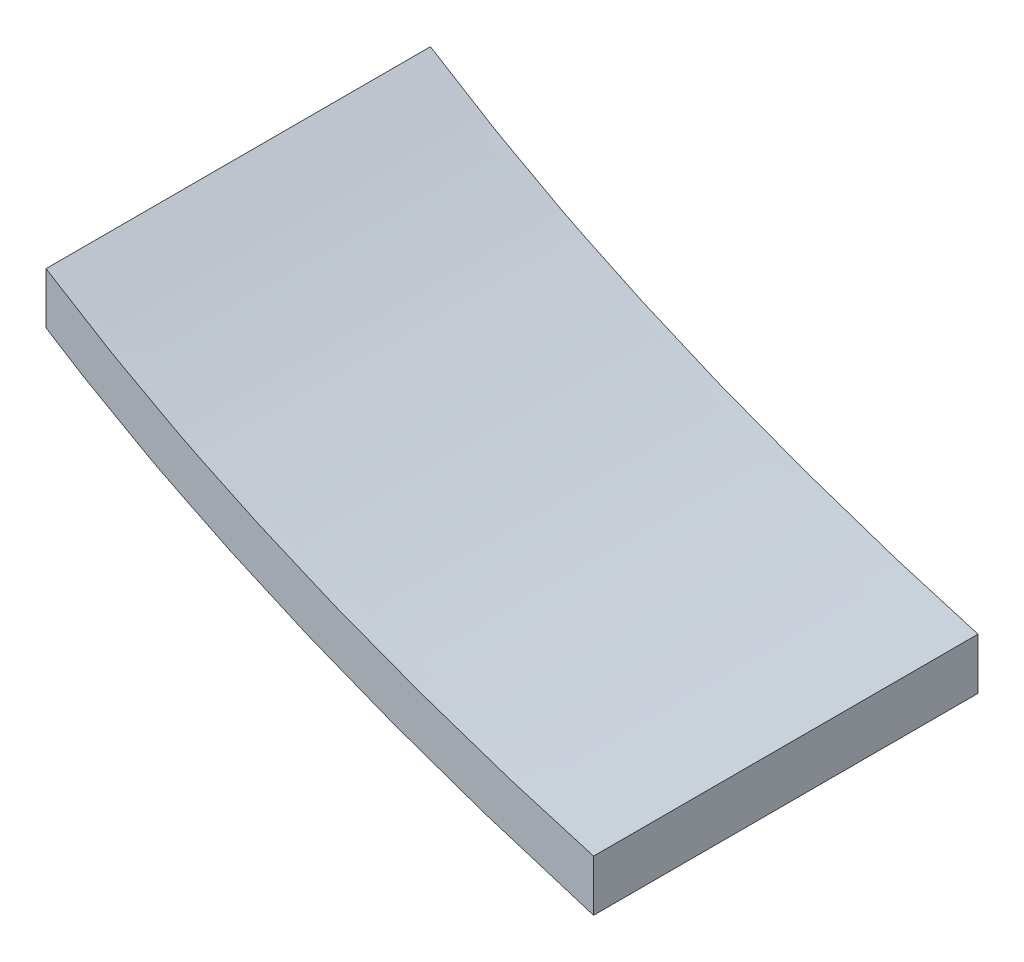
ISO-10303-21;
HEADER;
FILE_DESCRIPTION(('STEP AP214'),'2;1');
FILE_NAME('part.step','',(''),(''),'','','');
FILE_SCHEMA(('AUTOMOTIVE_DESIGN { 1 0 10303 214 1 1 1 1 }'));
ENDSEC;
DATA;
#1=APPLICATION_CONTEXT('core data for automotive mechanical design processes');
#2=APPLICATION_PROTOCOL_DEFINITION('international standard','automotive_design',2000,#1);
#3=PRODUCT_CONTEXT('',#1,'mechanical');
#4=PRODUCT('Part','Part','',(#3));
#5=PRODUCT_RELATED_PRODUCT_CATEGORY('part','',(#4));
#6=PRODUCT_DEFINITION_FORMATION('','',#4);
#7=PRODUCT_DEFINITION_CONTEXT('part definition',#1,'design');
#8=PRODUCT_DEFINITION('design','',#6,#7);
#9=PRODUCT_DEFINITION_SHAPE('','',#8);
#10=(LENGTH_UNIT() NAMED_UNIT(*) SI_UNIT(.MILLI.,.METRE.));
#11=(NAMED_UNIT(*) PLANE_ANGLE_UNIT() SI_UNIT($,.RADIAN.));
#12=(NAMED_UNIT(*) SI_UNIT($,.STERADIAN.) SOLID_ANGLE_UNIT());
#13=UNCERTAINTY_MEASURE_WITH_UNIT(LENGTH_MEASURE(1.E-05),#10,'distance_accuracy_value','');
#14=(GEOMETRIC_REPRESENTATION_CONTEXT(3) GLOBAL_UNCERTAINTY_ASSIGNED_CONTEXT((#13)) GLOBAL_UNIT_ASSIGNED_CONTEXT((#10,
#11,#12)) REPRESENTATION_CONTEXT('',''));
#15=CARTESIAN_POINT('',(0.,0.,0.));
#16=DIRECTION('',(0.,0.,1.));
#17=DIRECTION('',(1.,0.,0.));
#18=AXIS2_PLACEMENT_3D('',#15,#16,#17);
#19=CARTESIAN_POINT('',(0.,5.08,38.1));
#20=CARTESIAN_POINT('',(-2.66299660358424,5.86892612330493,38.1));
#21=CARTESIAN_POINT('',(-5.33725941297756,6.66118991668448,38.1));
#22=CARTESIAN_POINT('',(-8.02278842818282,7.45679138013968,38.1));
#23=CARTESIAN_POINT('',(-8.05651199886255,7.46706128449258,38.1));
#24=CARTESIAN_POINT('',(-8.11258412378838,7.48460329255471,38.1));
#25=CARTESIAN_POINT('',(-8.16865592145831,7.50214519823575,38.1));
#26=CARTESIAN_POINT('',(-8.22472739187246,7.51968700153572,38.1));
#27=CARTESIAN_POINT('',(-8.25825768898643,7.53057469398592,38.1));
#28=CARTESIAN_POINT('',(-11.206534394047,8.52314219338534,38.1));
#29=CARTESIAN_POINT('',(-14.1561430019538,9.51615809149655,38.1));
#30=CARTESIAN_POINT('',(-17.1070835127049,10.5096223883195,38.1));
#31=CARTESIAN_POINT('',(-17.1443836146619,10.5225241100001,38.1));
#32=CARTESIAN_POINT('',(-17.2063676074401,10.5445390973916,38.1));
#33=CARTESIAN_POINT('',(-17.2683513071834,10.5665539807053,38.1));
#34=CARTESIAN_POINT('',(-17.3303347138918,10.5885687599412,38.1));
#35=CARTESIAN_POINT('',(-17.3673835820756,10.6021778386223,38.1));
#36=CARTESIAN_POINT('',(-20.0720448471412,11.6288127143894,38.1));
#37=CARTESIAN_POINT('',(-22.7782649537858,12.6560392949849,38.1));
#38=CARTESIAN_POINT('',(-25.4860439020072,13.6838575804087,38.1));
#39=CARTESIAN_POINT('',(-25.5274412562662,13.7001075251253,38.1));
#40=CARTESIAN_POINT('',(-25.5961209807269,13.7279645036385,38.1));
#41=CARTESIAN_POINT('',(-25.6648010095304,13.7558216055952,38.1));
#42=CARTESIAN_POINT('',(-25.7334813426766,13.7836788309954,38.1));
#43=CARTESIAN_POINT('',(-25.7745381066301,13.8007684816882,38.1));
#44=CARTESIAN_POINT('',(-28.2590713259835,14.8615717552974,38.1));
#45=CARTESIAN_POINT('',(-30.7453277869751,15.923110788991,38.1));
#46=CARTESIAN_POINT('',(-33.233307489607,16.9853855827697,38.1));
#47=CARTESIAN_POINT('',(-33.279061910467,17.0058000697187,38.1));
#48=CARTESIAN_POINT('',(-33.3547465446443,17.0410438483114,38.1));
#49=CARTESIAN_POINT('',(-33.4304330538843,17.0762885000574,38.1));
#50=CARTESIAN_POINT('',(-33.5061214381868,17.1115340249568,38.1));
#51=CARTESIAN_POINT('',(-33.551459361371,17.1328429303718,38.1));
#52=CARTESIAN_POINT('',(-35.2974880174613,17.9610749104166,38.1));
#53=CARTESIAN_POINT('',(-37.1388137731881,18.8345112490779,38.1));
#54=CARTESIAN_POINT('',(-39.0754366285523,19.7531519463561,38.1));
#55=CARTESIAN_POINT('',(-39.4046383244067,19.9144152049986,38.1));
#56=CARTESIAN_POINT('',(-40.0883105494613,20.260055046833,38.1));
#57=CARTESIAN_POINT('',(-40.6796641544445,20.5590219479356,38.1));
#58=CARTESIAN_POINT('',(-41.178699139356,20.8113159083066,38.1));
#59=CARTESIAN_POINT('',(-41.2285243001655,20.8372938539547,38.1));
#60=CARTESIAN_POINT('',(-41.3110087118267,20.8816216632155,38.1));
#61=CARTESIAN_POINT('',(-41.3934943636765,20.925950138964,38.1));
#62=CARTESIAN_POINT('',(-41.4759812557149,20.9702792812001,38.1));
#63=CARTESIAN_POINT('',(-41.5254064441378,20.9970014906471,38.1));
#64=CARTESIAN_POINT('',(-43.1141773273524,21.8611657888336,38.1));
#65=CARTESIAN_POINT('',(-45.0464570828018,22.9121714413223,38.1));
#66=CARTESIAN_POINT('',(-47.3222457104867,24.1500184481135,38.1));
#67=CARTESIAN_POINT('',(-48.3862759509064,24.7672529837422,38.1));
#68=CARTESIAN_POINT('',(-50.6969881446039,26.1819543488048,38.1));
#69=CARTESIAN_POINT('',(-52.6582318041144,27.3826984699885,38.1));
#70=CARTESIAN_POINT('',(-54.2700069294378,28.3694853472933,38.1));
#71=B_SPLINE_CURVE_WITH_KNOTS('',3,(#19,#20,#21,#22,#23,#24,#25,#26,#27,#28,#29,#30,#31,#32,#33,
#34,#35,#36,#37,#38,#39,#40,#41,#42,#43,#44,#45,#46,#47,#48,#49,#50,#51,#52,#53,#54,#55,#56,#57,
#58,#59,#60,#61,#62,#63,#64,#65,#66,#67,#68,#69,#70),.UNSPECIFIED.,.F.,.F.,(4,1,1,1,1,1,1,1,1,1,
1,1,1,1,1,1,1,1,1,1,1,1,1,1,1,1,1,1,1,1,1,1,1,1,1,1,1,1,1,1,1,1,1,1,1,1,1,1,1,4),
(0.0449233413861967,0.179184036950996,0.179752046923823,0.18032005689665,0.180888066869477,
0.182592145895737,0.183160139292787,0.183728132689838,0.184296126086888,0.333540977424147,
0.33417690632593,0.334812835227713,0.335448764129497,0.337356616023416,0.337992529892835,
0.338628443762255,0.339264357631675,0.477839020489779,0.478555535404093,0.479272050318407,
0.47998856523272,0.482138246624214,0.482854777414714,0.483571308205214,0.484287838995714,
0.613447350206865,0.614254458397356,0.615061566587847,0.615868674778338,0.618290314630859,
0.619097522808397,0.619904730985935,0.620711939163473,0.712515716403292,0.718421628357469,
0.724327540311647,0.730233452265824,0.755454125144863,0.75635941124951,0.757264697354157,
0.758169983458804,0.760886054572712,0.761791408737387,0.762696762902063,0.763602117066739,
0.849219058272278,0.869027184140041,0.888835310007804,0.908643435875567,1.),.UNSPECIFIED.);
#72=DIRECTION('',(0.,0.,-1.));
#73=VECTOR('',#72,1.);
#74=SURFACE_OF_LINEAR_EXTRUSION('',#71,#73);
#75=CARTESIAN_POINT('',(0.,5.08,0.));
#76=CARTESIAN_POINT('',(-2.66299660358424,5.86892612330493,0.));
#77=CARTESIAN_POINT('',(-5.33725941297756,6.66118991668448,0.));
#78=CARTESIAN_POINT('',(-8.02278842818282,7.45679138013968,0.));
#79=CARTESIAN_POINT('',(-8.05651199886255,7.46706128449258,0.));
#80=CARTESIAN_POINT('',(-8.11258412378838,7.48460329255471,0.));
#81=CARTESIAN_POINT('',(-8.16865592145831,7.50214519823575,0.));
#82=CARTESIAN_POINT('',(-8.22472739187246,7.51968700153572,0.));
#83=CARTESIAN_POINT('',(-8.25825768898643,7.53057469398592,0.));
#84=CARTESIAN_POINT('',(-11.206534394047,8.52314219338534,0.));
#85=CARTESIAN_POINT('',(-14.1561430019538,9.51615809149655,0.));
#86=CARTESIAN_POINT('',(-17.1070835127049,10.5096223883195,0.));
#87=CARTESIAN_POINT('',(-17.1443836146619,10.5225241100001,0.));
#88=CARTESIAN_POINT('',(-17.2063676074401,10.5445390973916,0.));
#89=CARTESIAN_POINT('',(-17.2683513071834,10.5665539807053,0.));
#90=CARTESIAN_POINT('',(-17.3303347138918,10.5885687599412,0.));
#91=CARTESIAN_POINT('',(-17.3673835820756,10.6021778386223,0.));
#92=CARTESIAN_POINT('',(-20.0720448471412,11.6288127143894,0.));
#93=CARTESIAN_POINT('',(-22.7782649537858,12.6560392949849,0.));
#94=CARTESIAN_POINT('',(-25.4860439020072,13.6838575804087,0.));
#95=CARTESIAN_POINT('',(-25.5274412562662,13.7001075251253,0.));
#96=CARTESIAN_POINT('',(-25.5961209807269,13.7279645036385,0.));
#97=CARTESIAN_POINT('',(-25.6648010095304,13.7558216055952,0.));
#98=CARTESIAN_POINT('',(-25.7334813426766,13.7836788309954,0.));
#99=CARTESIAN_POINT('',(-25.7745381066301,13.8007684816882,0.));
#100=CARTESIAN_POINT('',(-28.2590713259835,14.8615717552974,0.));
#101=CARTESIAN_POINT('',(-30.7453277869751,15.923110788991,0.));
#102=CARTESIAN_POINT('',(-33.233307489607,16.9853855827697,0.));
#103=CARTESIAN_POINT('',(-33.279061910467,17.0058000697187,0.));
#104=CARTESIAN_POINT('',(-33.3547465446443,17.0410438483114,0.));
#105=CARTESIAN_POINT('',(-33.4304330538843,17.0762885000574,0.));
#106=CARTESIAN_POINT('',(-33.5061214381868,17.1115340249568,0.));
#107=CARTESIAN_POINT('',(-33.551459361371,17.1328429303718,0.));
#108=CARTESIAN_POINT('',(-35.2974880174613,17.9610749104166,0.));
#109=CARTESIAN_POINT('',(-37.1388137731881,18.8345112490779,0.));
#110=CARTESIAN_POINT('',(-39.0754366285523,19.7531519463561,0.));
#111=CARTESIAN_POINT('',(-39.4046383244067,19.9144152049986,0.));
#112=CARTESIAN_POINT('',(-40.0883105494613,20.260055046833,0.));
#113=CARTESIAN_POINT('',(-40.6796641544445,20.5590219479356,0.));
#114=CARTESIAN_POINT('',(-41.178699139356,20.8113159083066,0.));
#115=CARTESIAN_POINT('',(-41.2285243001655,20.8372938539547,0.));
#116=CARTESIAN_POINT('',(-41.3110087118267,20.8816216632155,0.));
#117=CARTESIAN_POINT('',(-41.3934943636765,20.925950138964,0.));
#118=CARTESIAN_POINT('',(-41.4759812557149,20.9702792812001,0.));
#119=CARTESIAN_POINT('',(-41.5254064441378,20.9970014906471,0.));
#120=CARTESIAN_POINT('',(-43.1141773273524,21.8611657888336,0.));
#121=CARTESIAN_POINT('',(-45.0464570828018,22.9121714413223,0.));
#122=CARTESIAN_POINT('',(-47.3222457104867,24.1500184481135,0.));
#123=CARTESIAN_POINT('',(-48.3862759509064,24.7672529837422,0.));
#124=CARTESIAN_POINT('',(-50.6969881446039,26.1819543488048,0.));
#125=CARTESIAN_POINT('',(-52.6582318041144,27.3826984699885,0.));
#126=CARTESIAN_POINT('',(-54.2700069294378,28.3694853472933,0.));
#127=B_SPLINE_CURVE_WITH_KNOTS('',3,(#75,#76,#77,#78,#79,#80,#81,#82,#83,#84,#85,#86,#87,#88,
#89,#90,#91,#92,#93,#94,#95,#96,#97,#98,#99,#100,#101,#102,#103,#104,#105,#106,#107,#108,#109,
#110,#111,#112,#113,#114,#115,#116,#117,#118,#119,#120,#121,#122,#123,#124,#125,#126),
.UNSPECIFIED.,.F.,.F.,(4,1,1,1,1,1,1,1,1,1,1,1,1,1,1,1,1,1,1,1,1,1,1,1,1,1,1,1,1,1,1,1,1,1,1,1,
1,1,1,1,1,1,1,1,1,1,1,1,1,4),(0.0449233413861967,0.179184036950996,0.179752046923823,
0.18032005689665,0.180888066869477,0.182592145895737,0.183160139292787,0.183728132689838,
0.184296126086888,0.333540977424147,0.33417690632593,0.334812835227713,0.335448764129497,
0.337356616023416,0.337992529892835,0.338628443762255,0.339264357631675,0.477839020489779,
0.478555535404093,0.479272050318407,0.47998856523272,0.482138246624214,0.482854777414714,
0.483571308205214,0.484287838995714,0.613447350206865,0.614254458397356,0.615061566587847,
0.615868674778338,0.618290314630859,0.619097522808397,0.619904730985935,0.620711939163473,
0.712515716403292,0.718421628357469,0.724327540311647,0.730233452265824,0.755454125144863,
0.75635941124951,0.757264697354157,0.758169983458804,0.760886054572712,0.761791408737387,
0.762696762902063,0.763602117066739,0.849219058272278,0.869027184140041,0.888835310007804,
0.908643435875567,1.),.UNSPECIFIED.);
#128=CARTESIAN_POINT('',(0.,5.08,0.));
#129=VERTEX_POINT('',#128);
#130=CARTESIAN_POINT('',(-54.2700069294378,28.3694853472933,0.));
#131=VERTEX_POINT('',#130);
#132=EDGE_CURVE('E122',#129,#131,#127,.T.);
#133=ORIENTED_EDGE('',*,*,#132,.T.);
#134=DIRECTION('',(0.,0.,-1.));
#135=VECTOR('',#134,1.);
#136=CARTESIAN_POINT('',(-54.2700069294378,28.3694853472933,38.1));
#137=LINE('',#136,#135);
#138=CARTESIAN_POINT('',(-54.2700069294378,28.3694853472933,38.1));
#139=VERTEX_POINT('',#138);
#140=EDGE_CURVE('E11',#139,#131,#137,.T.);
#141=ORIENTED_EDGE('',*,*,#140,.F.);
#142=CARTESIAN_POINT('',(0.,5.08,38.1));
#143=VERTEX_POINT('',#142);
#144=EDGE_CURVE('E91',#143,#139,#71,.T.);
#145=ORIENTED_EDGE('',*,*,#144,.F.);
#146=DIRECTION('',(0.,0.,-1.));
#147=VECTOR('',#146,1.);
#148=CARTESIAN_POINT('',(0.,5.08,38.1));
#149=LINE('',#148,#147);
#150=EDGE_CURVE('E99',#143,#129,#149,.T.);
#151=ORIENTED_EDGE('',*,*,#150,.T.);
#152=EDGE_LOOP('',(#133,#141,#145,#151));
#153=FACE_BOUND('',#152,.T.);
#154=ADVANCED_FACE('F39',(#153),#74,.F.);
#155=CARTESIAN_POINT('',(-54.2700069294378,28.3694853472933,38.1));
#156=DIRECTION('',(1.,0.,0.));
#157=DIRECTION('',(0.,1.,0.));
#158=AXIS2_PLACEMENT_3D('',#155,#156,#157);
#159=PLANE('',#158);
#160=DIRECTION('',(0.,-1.,0.));
#161=VECTOR('',#160,1.);
#162=CARTESIAN_POINT('',(-54.2700069294378,28.3694853472933,0.));
#163=LINE('',#162,#161);
#164=CARTESIAN_POINT('',(-54.2700069294378,23.2894853472933,0.));
#165=VERTEX_POINT('',#164);
#166=EDGE_CURVE('E95',#131,#165,#163,.T.);
#167=ORIENTED_EDGE('',*,*,#166,.T.);
#168=DIRECTION('',(0.,0.,-1.));
#169=VECTOR('',#168,1.);
#170=CARTESIAN_POINT('',(-54.2700069294378,23.2894853472933,38.1));
#171=LINE('',#170,#169);
#172=CARTESIAN_POINT('',(-54.2700069294378,23.2894853472933,38.1));
#173=VERTEX_POINT('',#172);
#174=EDGE_CURVE('E48',#173,#165,#171,.T.);
#175=ORIENTED_EDGE('',*,*,#174,.F.);
#176=DIRECTION('',(0.,-1.,0.));
#177=VECTOR('',#176,1.);
#178=CARTESIAN_POINT('',(-54.2700069294378,28.3694853472933,38.1));
#179=LINE('',#178,#177);
#180=EDGE_CURVE('E86',#139,#173,#179,.T.);
#181=ORIENTED_EDGE('',*,*,#180,.F.);
#182=ORIENTED_EDGE('',*,*,#140,.T.);
#183=EDGE_LOOP('',(#167,#175,#181,#182));
#184=FACE_BOUND('',#183,.T.);
#185=ADVANCED_FACE('F94',(#184),#159,.F.);
#186=CARTESIAN_POINT('',(-54.2700069294378,23.2894853472933,38.1));
#187=CARTESIAN_POINT('',(-53.5549258877105,22.8385254405699,38.1));
#188=CARTESIAN_POINT('',(-52.491230830428,22.1677150067546,38.1));
#189=CARTESIAN_POINT('',(-51.0789217575905,21.2770540458473,38.1));
#190=CARTESIAN_POINT('',(-50.0170365025595,20.6420721948004,38.1));
#191=CARTESIAN_POINT('',(-47.7447363147321,19.3667383207211,38.1));
#192=CARTESIAN_POINT('',(-45.8154184519791,18.2839040907121,38.1));
#193=CARTESIAN_POINT('',(-44.2290829142997,17.3935695047731,38.1));
#194=CARTESIAN_POINT('',(-44.1797313352243,17.3660340854584,38.1));
#195=CARTESIAN_POINT('',(-44.0973637098631,17.3203492946834,38.1));
#196=CARTESIAN_POINT('',(-44.0149973228975,17.2746651907783,38.1));
#197=CARTESIAN_POINT('',(-43.9326321743272,17.228981773743,38.1));
#198=CARTESIAN_POINT('',(-43.8828683911087,17.2021895421219,38.1));
#199=CARTESIAN_POINT('',(-43.3843427253378,16.9417851602058,38.1));
#200=CARTESIAN_POINT('',(-42.7935926606255,16.6332074559256,38.1));
#201=CARTESIAN_POINT('',(-42.1106181969718,16.2764564292815,38.1));
#202=CARTESIAN_POINT('',(-41.7816834540221,16.1098725403258,38.1));
#203=CARTESIAN_POINT('',(-39.8462298955411,15.1601038591356,38.1));
#204=CARTESIAN_POINT('',(-38.0060158980799,14.2570712785719,38.1));
#205=CARTESIAN_POINT('',(-36.2610414616379,13.4007747986342,38.1));
#206=CARTESIAN_POINT('',(-36.2157282787682,13.3787382919919,38.1));
#207=CARTESIAN_POINT('',(-36.1400768142356,13.3422799701231,38.1));
#208=CARTESIAN_POINT('',(-36.064427223851,13.3058225514529,38.1));
#209=CARTESIAN_POINT('',(-35.9887795076144,13.2693660359812,38.1));
#210=CARTESIAN_POINT('',(-35.9430354953216,13.2482235115571,38.1));
#211=CARTESIAN_POINT('',(-33.4549834188823,12.1466343041247,38.1));
#212=CARTESIAN_POINT('',(-30.9686546342115,11.0458080869975,38.1));
#213=CARTESIAN_POINT('',(-28.4840491413068,9.94574486017453,38.1));
#214=CARTESIAN_POINT('',(-28.442985306126,9.92800896310921,38.1));
#215=CARTESIAN_POINT('',(-28.3742833873539,9.8990748747058,38.1));
#216=CARTESIAN_POINT('',(-28.3055817730202,9.87014091451784,38.1));
#217=CARTESIAN_POINT('',(-28.2368804631249,9.84120708254532,38.1));
#218=CARTESIAN_POINT('',(-28.1954628715963,9.82431115537284,38.1));
#219=CARTESIAN_POINT('',(-25.4858917023254,8.75444055842122,38.1));
#220=CARTESIAN_POINT('',(-22.7778804063952,7.68518587539812,38.1));
#221=CARTESIAN_POINT('',(-20.0714289838078,6.61654710630349,38.1));
#222=CARTESIAN_POINT('',(-20.0343495317057,6.6023652532774,38.1));
#223=CARTESIAN_POINT('',(-19.9723048954279,6.57939653058544,38.1));
#224=CARTESIAN_POINT('',(-19.9102599658257,6.55642769930578,38.1));
#225=CARTESIAN_POINT('',(-19.8482147428992,6.53345875943838,38.1));
#226=CARTESIAN_POINT('',(-19.8108731705832,6.5199849621634,38.1));
#227=CARTESIAN_POINT('',(-16.8562880692535,5.48141786973615,38.1));
#228=CARTESIAN_POINT('',(-13.903036515749,4.44331953310394,38.1));
#229=CARTESIAN_POINT('',(-10.9511185100715,3.40568995226684,38.1));
#230=CARTESIAN_POINT('',(-10.9175414507476,3.39429207171659,38.1));
#231=CARTESIAN_POINT('',(-10.8613828969521,3.37590091258546,38.1));
#232=CARTESIAN_POINT('',(-10.8052240153927,3.35750964611607,38.1));
#233=CARTESIAN_POINT('',(-10.7490648060691,3.33911827230841,38.1));
#234=CARTESIAN_POINT('',(-10.7152851150867,3.32833913932496,38.1));
#235=CARTESIAN_POINT('',(-7.16860478060973,2.22618630199118,38.1));
#236=CARTESIAN_POINT('',(-3.62838022380909,1.1260396374758,38.1));
#237=CARTESIAN_POINT('',(-0.0946114446781902,0.0278991457763839,38.1));
#238=CARTESIAN_POINT('',(-0.0800842577895716,0.02350990254153,38.1));
#239=CARTESIAN_POINT('',(-0.0485360369955586,0.0142484619451202,38.1));
#240=CARTESIAN_POINT('',(-0.0218412843990223,0.00641182776460601,38.1));
#241=CARTESIAN_POINT('',(0.,0.,38.1));
#242=B_SPLINE_CURVE_WITH_KNOTS('',3,(#186,#187,#188,#189,#190,#191,#192,#193,#194,#195,#196,
#197,#198,#199,#200,#201,#202,#203,#204,#205,#206,#207,#208,#209,#210,#211,#212,#213,#214,#215,
#216,#217,#218,#219,#220,#221,#222,#223,#224,#225,#226,#227,#228,#229,#230,#231,#232,#233,#234,
#235,#236,#237,#238,#239,#240,#241),.UNSPECIFIED.,.F.,.F.,(4,1,1,1,1,1,1,1,1,1,1,1,1,1,1,1,1,1,
1,1,1,1,1,1,1,1,1,1,1,1,1,1,1,1,1,1,1,1,1,1,1,1,1,1,1,1,1,1,1,1,1,1,1,4),(0.,0.0406306535255937,
0.0604387793933566,0.0802469052611197,0.100055031128883,0.185671972334422,0.186577326499098,
0.187482680663774,0.188388034828449,0.191104105942357,0.192009392047004,0.192914678151651,
0.193819964256298,0.219040637135337,0.224946549089514,0.230852461043692,0.236758372997869,
0.328562150237688,0.329369358415226,0.330176566592764,0.330983774770302,0.333405414622823,
0.334212522813314,0.335019631003805,0.335826739194296,0.464986250405446,0.465702781195947,
0.466419311986447,0.467135842776947,0.469285524168441,0.470002039082754,0.470718553997068,
0.471435068911382,0.610009731769486,0.610645645638906,0.611281559508326,0.611917473377745,
0.613825325271664,0.614461254173448,0.615097183075231,0.615733111977014,0.764977963314273,
0.765545956711323,0.766113950108374,0.766681943505424,0.768386022531684,0.768954032504511,
0.769522042477338,0.770090052450165,0.947450770456298,0.947693875124185,0.947936979792071,
0.948180084459958,0.949274089401161),.UNSPECIFIED.);
#243=DIRECTION('',(0.,0.,-1.));
#244=VECTOR('',#243,1.);
#245=SURFACE_OF_LINEAR_EXTRUSION('',#242,#244);
#246=CARTESIAN_POINT('',(-54.2700069294378,23.2894853472933,0.));
#247=CARTESIAN_POINT('',(-53.5549258877105,22.8385254405699,0.));
#248=CARTESIAN_POINT('',(-52.491230830428,22.1677150067546,0.));
#249=CARTESIAN_POINT('',(-51.0789217575905,21.2770540458473,0.));
#250=CARTESIAN_POINT('',(-50.0170365025595,20.6420721948004,0.));
#251=CARTESIAN_POINT('',(-47.7447363147321,19.3667383207211,0.));
#252=CARTESIAN_POINT('',(-45.8154184519791,18.2839040907121,0.));
#253=CARTESIAN_POINT('',(-44.2290829142997,17.3935695047731,0.));
#254=CARTESIAN_POINT('',(-44.1797313352243,17.3660340854584,0.));
#255=CARTESIAN_POINT('',(-44.0973637098631,17.3203492946834,0.));
#256=CARTESIAN_POINT('',(-44.0149973228975,17.2746651907783,0.));
#257=CARTESIAN_POINT('',(-43.9326321743272,17.228981773743,0.));
#258=CARTESIAN_POINT('',(-43.8828683911087,17.2021895421219,0.));
#259=CARTESIAN_POINT('',(-43.3843427253378,16.9417851602058,0.));
#260=CARTESIAN_POINT('',(-42.7935926606255,16.6332074559256,0.));
#261=CARTESIAN_POINT('',(-42.1106181969718,16.2764564292815,0.));
#262=CARTESIAN_POINT('',(-41.7816834540221,16.1098725403258,0.));
#263=CARTESIAN_POINT('',(-39.8462298955411,15.1601038591356,0.));
#264=CARTESIAN_POINT('',(-38.0060158980799,14.2570712785719,0.));
#265=CARTESIAN_POINT('',(-36.2610414616379,13.4007747986342,0.));
#266=CARTESIAN_POINT('',(-36.2157282787682,13.3787382919919,0.));
#267=CARTESIAN_POINT('',(-36.1400768142356,13.3422799701231,0.));
#268=CARTESIAN_POINT('',(-36.064427223851,13.3058225514529,0.));
#269=CARTESIAN_POINT('',(-35.9887795076144,13.2693660359812,0.));
#270=CARTESIAN_POINT('',(-35.9430354953216,13.2482235115571,0.));
#271=CARTESIAN_POINT('',(-33.4549834188823,12.1466343041247,0.));
#272=CARTESIAN_POINT('',(-30.9686546342115,11.0458080869975,0.));
#273=CARTESIAN_POINT('',(-28.4840491413068,9.94574486017453,0.));
#274=CARTESIAN_POINT('',(-28.442985306126,9.92800896310921,0.));
#275=CARTESIAN_POINT('',(-28.3742833873539,9.8990748747058,0.));
#276=CARTESIAN_POINT('',(-28.3055817730202,9.87014091451784,0.));
#277=CARTESIAN_POINT('',(-28.2368804631249,9.84120708254532,0.));
#278=CARTESIAN_POINT('',(-28.1954628715963,9.82431115537284,0.));
#279=CARTESIAN_POINT('',(-25.4858917023254,8.75444055842122,0.));
#280=CARTESIAN_POINT('',(-22.7778804063952,7.68518587539812,0.));
#281=CARTESIAN_POINT('',(-20.0714289838078,6.61654710630349,0.));
#282=CARTESIAN_POINT('',(-20.0343495317057,6.6023652532774,0.));
#283=CARTESIAN_POINT('',(-19.9723048954279,6.57939653058544,0.));
#284=CARTESIAN_POINT('',(-19.9102599658257,6.55642769930578,0.));
#285=CARTESIAN_POINT('',(-19.8482147428992,6.53345875943838,0.));
#286=CARTESIAN_POINT('',(-19.8108731705832,6.5199849621634,0.));
#287=CARTESIAN_POINT('',(-16.8562880692535,5.48141786973615,0.));
#288=CARTESIAN_POINT('',(-13.903036515749,4.44331953310394,0.));
#289=CARTESIAN_POINT('',(-10.9511185100715,3.40568995226684,0.));
#290=CARTESIAN_POINT('',(-10.9175414507476,3.39429207171659,0.));
#291=CARTESIAN_POINT('',(-10.8613828969521,3.37590091258546,0.));
#292=CARTESIAN_POINT('',(-10.8052240153927,3.35750964611607,0.));
#293=CARTESIAN_POINT('',(-10.7490648060691,3.33911827230841,0.));
#294=CARTESIAN_POINT('',(-10.7152851150867,3.32833913932496,0.));
#295=CARTESIAN_POINT('',(-7.16860478060973,2.22618630199118,0.));
#296=CARTESIAN_POINT('',(-3.62838022380909,1.1260396374758,0.));
#297=CARTESIAN_POINT('',(-0.0946114446781902,0.0278991457763839,0.));
#298=CARTESIAN_POINT('',(-0.0800842577895716,0.02350990254153,0.));
#299=CARTESIAN_POINT('',(-0.0485360369955586,0.0142484619451202,0.));
#300=CARTESIAN_POINT('',(-0.0218412843990223,0.00641182776460601,0.));
#301=CARTESIAN_POINT('',(0.,0.,0.));
#302=B_SPLINE_CURVE_WITH_KNOTS('',3,(#246,#247,#248,#249,#250,#251,#252,#253,#254,#255,#256,
#257,#258,#259,#260,#261,#262,#263,#264,#265,#266,#267,#268,#269,#270,#271,#272,#273,#274,#275,
#276,#277,#278,#279,#280,#281,#282,#283,#284,#285,#286,#287,#288,#289,#290,#291,#292,#293,#294,
#295,#296,#297,#298,#299,#300,#301),.UNSPECIFIED.,.F.,.F.,(4,1,1,1,1,1,1,1,1,1,1,1,1,1,1,1,1,1,
1,1,1,1,1,1,1,1,1,1,1,1,1,1,1,1,1,1,1,1,1,1,1,1,1,1,1,1,1,1,1,1,1,1,1,4),(0.,0.0406306535255937,
0.0604387793933566,0.0802469052611197,0.100055031128883,0.185671972334422,0.186577326499098,
0.187482680663774,0.188388034828449,0.191104105942357,0.192009392047004,0.192914678151651,
0.193819964256298,0.219040637135337,0.224946549089514,0.230852461043692,0.236758372997869,
0.328562150237688,0.329369358415226,0.330176566592764,0.330983774770302,0.333405414622823,
0.334212522813314,0.335019631003805,0.335826739194296,0.464986250405446,0.465702781195947,
0.466419311986447,0.467135842776947,0.469285524168441,0.470002039082754,0.470718553997068,
0.471435068911382,0.610009731769486,0.610645645638906,0.611281559508326,0.611917473377745,
0.613825325271664,0.614461254173448,0.615097183075231,0.615733111977014,0.764977963314273,
0.765545956711323,0.766113950108374,0.766681943505424,0.768386022531684,0.768954032504511,
0.769522042477338,0.770090052450165,0.947450770456298,0.947693875124185,0.947936979792071,
0.948180084459958,0.949274089401161),.UNSPECIFIED.);
#303=CARTESIAN_POINT('',(0.,0.,0.));
#304=VERTEX_POINT('',#303);
#305=EDGE_CURVE('E73',#165,#304,#302,.T.);
#306=ORIENTED_EDGE('',*,*,#305,.T.);
#307=DIRECTION('',(0.,0.,-1.));
#308=VECTOR('',#307,1.);
#309=CARTESIAN_POINT('',(0.,0.,38.1));
#310=LINE('',#309,#308);
#311=CARTESIAN_POINT('',(0.,0.,38.1));
#312=VERTEX_POINT('',#311);
#313=EDGE_CURVE('E96',#312,#304,#310,.T.);
#314=ORIENTED_EDGE('',*,*,#313,.F.);
#315=EDGE_CURVE('E89',#173,#312,#242,.T.);
#316=ORIENTED_EDGE('',*,*,#315,.F.);
#317=ORIENTED_EDGE('',*,*,#174,.T.);
#318=EDGE_LOOP('',(#306,#314,#316,#317));
#319=FACE_BOUND('',#318,.T.);
#320=ADVANCED_FACE('F97',(#319),#245,.F.);
#321=CARTESIAN_POINT('',(0.,0.,38.1));
#322=DIRECTION('',(-1.,0.,0.));
#323=DIRECTION('',(0.,0.,1.));
#324=AXIS2_PLACEMENT_3D('',#321,#322,#323);
#325=PLANE('',#324);
#326=DIRECTION('',(0.,1.,0.));
#327=VECTOR('',#326,1.);
#328=CARTESIAN_POINT('',(0.,0.,0.));
#329=LINE('',#328,#327);
#330=EDGE_CURVE('E79',#304,#129,#329,.T.);
#331=ORIENTED_EDGE('',*,*,#330,.T.);
#332=ORIENTED_EDGE('',*,*,#150,.F.);
#333=DIRECTION('',(0.,1.,0.));
#334=VECTOR('',#333,1.);
#335=CARTESIAN_POINT('',(0.,0.,38.1));
#336=LINE('',#335,#334);
#337=EDGE_CURVE('E56',#312,#143,#336,.T.);
#338=ORIENTED_EDGE('',*,*,#337,.F.);
#339=ORIENTED_EDGE('',*,*,#313,.T.);
#340=EDGE_LOOP('',(#331,#332,#338,#339));
#341=FACE_BOUND('',#340,.T.);
#342=ADVANCED_FACE('F111',(#341),#325,.F.);
#343=CARTESIAN_POINT('',(-27.9942140525421,14.7484875507808,38.1));
#344=DIRECTION('',(0.,0.,1.));
#345=DIRECTION('',(1.,0.,0.));
#346=AXIS2_PLACEMENT_3D('',#343,#344,#345);
#347=PLANE('',#346);
#348=ORIENTED_EDGE('',*,*,#144,.T.);
#349=ORIENTED_EDGE('',*,*,#180,.T.);
#350=ORIENTED_EDGE('',*,*,#315,.T.);
#351=ORIENTED_EDGE('',*,*,#337,.T.);
#352=EDGE_LOOP('',(#348,#349,#350,#351));
#353=FACE_BOUND('',#352,.T.);
#354=ADVANCED_FACE('F87',(#353),#347,.T.);
#355=CARTESIAN_POINT('',(-27.9942140525421,14.7484875507808,0.));
#356=DIRECTION('',(0.,0.,1.));
#357=DIRECTION('',(1.,0.,0.));
#358=AXIS2_PLACEMENT_3D('',#355,#356,#357);
#359=PLANE('',#358);
#360=ORIENTED_EDGE('',*,*,#132,.F.);
#361=ORIENTED_EDGE('',*,*,#330,.F.);
#362=ORIENTED_EDGE('',*,*,#305,.F.);
#363=ORIENTED_EDGE('',*,*,#166,.F.);
#364=EDGE_LOOP('',(#360,#361,#362,#363));
#365=FACE_BOUND('',#364,.T.);
#366=ADVANCED_FACE('F139',(#365),#359,.F.);
#367=CLOSED_SHELL('',(#154,#185,#320,#342,#354,#366));
#368=MANIFOLD_SOLID_BREP('B2',#367);
#369=ADVANCED_BREP_SHAPE_REPRESENTATION('',(#18,#368),#14);
#370=SHAPE_DEFINITION_REPRESENTATION(#9,#369);
ENDSEC;
END-ISO-10303-21;
